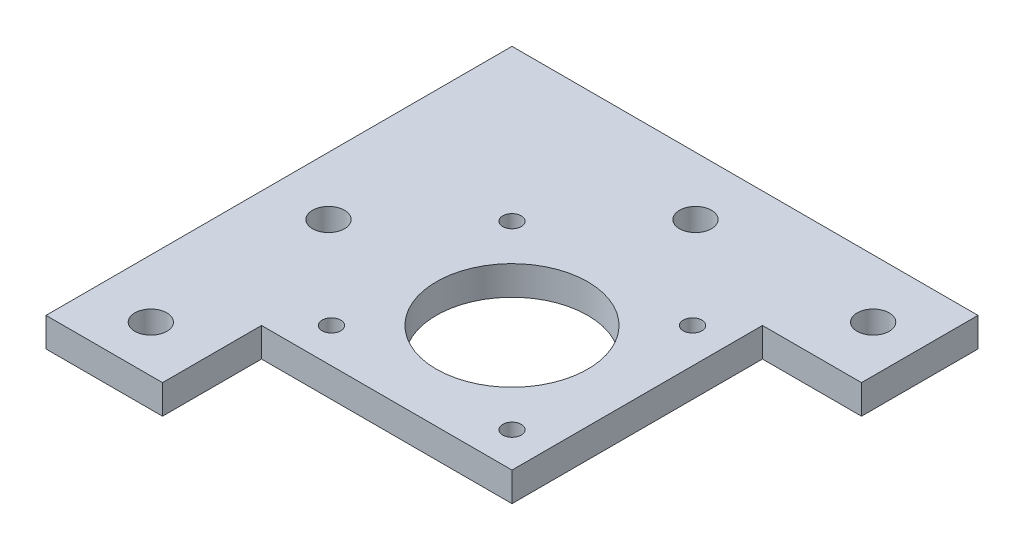
ISO-10303-21;
HEADER;
FILE_DESCRIPTION(('STEP AP214'),'2;1');
FILE_NAME('part.step','',(''),(''),'','','');
FILE_SCHEMA(('AUTOMOTIVE_DESIGN { 1 0 10303 214 1 1 1 1 }'));
ENDSEC;
DATA;
#1=APPLICATION_CONTEXT('core data for automotive mechanical design processes');
#2=APPLICATION_PROTOCOL_DEFINITION('international standard','automotive_design',2000,#1);
#3=PRODUCT_CONTEXT('',#1,'mechanical');
#4=PRODUCT('Part','Part','',(#3));
#5=PRODUCT_RELATED_PRODUCT_CATEGORY('part','',(#4));
#6=PRODUCT_DEFINITION_FORMATION('','',#4);
#7=PRODUCT_DEFINITION_CONTEXT('part definition',#1,'design');
#8=PRODUCT_DEFINITION('design','',#6,#7);
#9=PRODUCT_DEFINITION_SHAPE('','',#8);
#10=(LENGTH_UNIT() NAMED_UNIT(*) SI_UNIT(.MILLI.,.METRE.));
#11=(NAMED_UNIT(*) PLANE_ANGLE_UNIT() SI_UNIT($,.RADIAN.));
#12=(NAMED_UNIT(*) SI_UNIT($,.STERADIAN.) SOLID_ANGLE_UNIT());
#13=UNCERTAINTY_MEASURE_WITH_UNIT(LENGTH_MEASURE(1.E-05),#10,'distance_accuracy_value','');
#14=(GEOMETRIC_REPRESENTATION_CONTEXT(3) GLOBAL_UNCERTAINTY_ASSIGNED_CONTEXT((#13)) GLOBAL_UNIT_ASSIGNED_CONTEXT((#10,
#11,#12)) REPRESENTATION_CONTEXT('',''));
#15=CARTESIAN_POINT('',(0.,0.,0.));
#16=DIRECTION('',(0.,0.,1.));
#17=DIRECTION('',(1.,0.,0.));
#18=AXIS2_PLACEMENT_3D('',#15,#16,#17);
#19=CARTESIAN_POINT('',(0.,5.,0.));
#20=DIRECTION('',(0.,1.,0.));
#21=DIRECTION('',(0.,0.,1.));
#22=AXIS2_PLACEMENT_3D('',#19,#20,#21);
#23=PLANE('',#22);
#24=CARTESIAN_POINT('',(72.,5.,-70.));
#25=DIRECTION('',(0.,1.,0.));
#26=DIRECTION('',(0.,0.,1.));
#27=AXIS2_PLACEMENT_3D('',#24,#25,#26);
#28=CIRCLE('',#27,2.75000000000001);
#29=CARTESIAN_POINT('',(72.,5.,-67.25));
#30=VERTEX_POINT('',#29);
#31=EDGE_CURVE('E261',#30,#30,#28,.T.);
#32=ORIENTED_EDGE('',*,*,#31,.F.);
#33=EDGE_LOOP('',(#32));
#34=FACE_BOUND('',#33,.T.);
#35=CARTESIAN_POINT('',(10.,5.,-7.99999999999999));
#36=DIRECTION('',(0.,1.,0.));
#37=DIRECTION('',(0.,0.,1.));
#38=AXIS2_PLACEMENT_3D('',#35,#36,#37);
#39=CIRCLE('',#38,2.75);
#40=CARTESIAN_POINT('',(10.,5.,-5.25));
#41=VERTEX_POINT('',#40);
#42=EDGE_CURVE('E245',#41,#41,#39,.T.);
#43=ORIENTED_EDGE('',*,*,#42,.F.);
#44=EDGE_LOOP('',(#43));
#45=FACE_BOUND('',#44,.T.);
#46=CARTESIAN_POINT('',(26.,5.,-54.));
#47=DIRECTION('',(0.,1.,0.));
#48=DIRECTION('',(0.,0.,1.));
#49=AXIS2_PLACEMENT_3D('',#46,#47,#48);
#50=CIRCLE('',#49,1.6);
#51=CARTESIAN_POINT('',(26.,5.,-52.4));
#52=VERTEX_POINT('',#51);
#53=EDGE_CURVE('E229',#52,#52,#50,.T.);
#54=ORIENTED_EDGE('',*,*,#53,.F.);
#55=EDGE_LOOP('',(#54));
#56=FACE_BOUND('',#55,.T.);
#57=CARTESIAN_POINT('',(57.,5.,-54.));
#58=DIRECTION('',(0.,1.,0.));
#59=DIRECTION('',(0.,0.,1.));
#60=AXIS2_PLACEMENT_3D('',#57,#58,#59);
#61=CIRCLE('',#60,1.6);
#62=CARTESIAN_POINT('',(57.,5.,-52.4));
#63=VERTEX_POINT('',#62);
#64=EDGE_CURVE('E213',#63,#63,#61,.T.);
#65=ORIENTED_EDGE('',*,*,#64,.F.);
#66=EDGE_LOOP('',(#65));
#67=FACE_BOUND('',#66,.T.);
#68=DIRECTION('',(0.,0.,1.));
#69=VECTOR('',#68,1.);
#70=CARTESIAN_POINT('',(0.,5.,-80.));
#71=LINE('',#70,#69);
#72=CARTESIAN_POINT('',(0.,5.,-80.));
#73=VERTEX_POINT('',#72);
#74=CARTESIAN_POINT('',(0.,5.,0.));
#75=VERTEX_POINT('',#74);
#76=EDGE_CURVE('E164',#73,#75,#71,.T.);
#77=ORIENTED_EDGE('',*,*,#76,.T.);
#78=DIRECTION('',(1.,0.,0.));
#79=VECTOR('',#78,1.);
#80=CARTESIAN_POINT('',(0.,5.,0.));
#81=LINE('',#80,#79);
#82=CARTESIAN_POINT('',(20.,5.,0.));
#83=VERTEX_POINT('',#82);
#84=EDGE_CURVE('E100',#75,#83,#81,.T.);
#85=ORIENTED_EDGE('',*,*,#84,.T.);
#86=DIRECTION('',(0.,0.,-1.));
#87=VECTOR('',#86,1.);
#88=CARTESIAN_POINT('',(20.,5.,0.));
#89=LINE('',#88,#87);
#90=CARTESIAN_POINT('',(20.,5.,-17.));
#91=VERTEX_POINT('',#90);
#92=EDGE_CURVE('E185',#83,#91,#89,.T.);
#93=ORIENTED_EDGE('',*,*,#92,.T.);
#94=DIRECTION('',(1.,0.,0.));
#95=VECTOR('',#94,1.);
#96=CARTESIAN_POINT('',(20.,5.,-17.));
#97=LINE('',#96,#95);
#98=CARTESIAN_POINT('',(63.,5.,-17.));
#99=VERTEX_POINT('',#98);
#100=EDGE_CURVE('E199',#91,#99,#97,.T.);
#101=ORIENTED_EDGE('',*,*,#100,.T.);
#102=DIRECTION('',(0.,0.,-1.));
#103=VECTOR('',#102,1.);
#104=CARTESIAN_POINT('',(63.,5.,-17.));
#105=LINE('',#104,#103);
#106=CARTESIAN_POINT('',(63.,5.,-60.));
#107=VERTEX_POINT('',#106);
#108=EDGE_CURVE('E119',#99,#107,#105,.T.);
#109=ORIENTED_EDGE('',*,*,#108,.T.);
#110=DIRECTION('',(1.,0.,0.));
#111=VECTOR('',#110,1.);
#112=CARTESIAN_POINT('',(63.,5.,-60.));
#113=LINE('',#112,#111);
#114=CARTESIAN_POINT('',(80.,5.,-60.));
#115=VERTEX_POINT('',#114);
#116=EDGE_CURVE('E113',#107,#115,#113,.T.);
#117=ORIENTED_EDGE('',*,*,#116,.T.);
#118=DIRECTION('',(0.,0.,-1.));
#119=VECTOR('',#118,1.);
#120=CARTESIAN_POINT('',(80.,5.,-60.));
#121=LINE('',#120,#119);
#122=CARTESIAN_POINT('',(80.,5.,-80.));
#123=VERTEX_POINT('',#122);
#124=EDGE_CURVE('E117',#115,#123,#121,.T.);
#125=ORIENTED_EDGE('',*,*,#124,.T.);
#126=DIRECTION('',(-1.,0.,0.));
#127=VECTOR('',#126,1.);
#128=CARTESIAN_POINT('',(80.,5.,-80.));
#129=LINE('',#128,#127);
#130=EDGE_CURVE('E57',#123,#73,#129,.T.);
#131=ORIENTED_EDGE('',*,*,#130,.T.);
#132=EDGE_LOOP('',(#77,#85,#93,#101,#109,#117,#125,#131));
#133=FACE_BOUND('',#132,.T.);
#134=CARTESIAN_POINT('',(57.,5.,-23.));
#135=DIRECTION('',(0.,1.,0.));
#136=DIRECTION('',(0.,0.,1.));
#137=AXIS2_PLACEMENT_3D('',#134,#135,#136);
#138=CIRCLE('',#137,1.6);
#139=CARTESIAN_POINT('',(57.,5.,-21.4));
#140=VERTEX_POINT('',#139);
#141=EDGE_CURVE('E146',#140,#140,#138,.T.);
#142=ORIENTED_EDGE('',*,*,#141,.F.);
#143=EDGE_LOOP('',(#142));
#144=FACE_BOUND('',#143,.T.);
#145=CARTESIAN_POINT('',(26.,5.,-23.));
#146=DIRECTION('',(0.,1.,0.));
#147=DIRECTION('',(0.,0.,1.));
#148=AXIS2_PLACEMENT_3D('',#145,#146,#147);
#149=CIRCLE('',#148,1.6);
#150=CARTESIAN_POINT('',(26.,5.,-21.4));
#151=VERTEX_POINT('',#150);
#152=EDGE_CURVE('E221',#151,#151,#149,.T.);
#153=ORIENTED_EDGE('',*,*,#152,.F.);
#154=EDGE_LOOP('',(#153));
#155=FACE_BOUND('',#154,.T.);
#156=CARTESIAN_POINT('',(41.5,5.,-38.5));
#157=DIRECTION('',(0.,1.,0.));
#158=DIRECTION('',(0.,0.,1.));
#159=AXIS2_PLACEMENT_3D('',#156,#157,#158);
#160=CIRCLE('',#159,13.);
#161=CARTESIAN_POINT('',(41.5,5.,-25.5));
#162=VERTEX_POINT('',#161);
#163=EDGE_CURVE('E237',#162,#162,#160,.T.);
#164=ORIENTED_EDGE('',*,*,#163,.F.);
#165=EDGE_LOOP('',(#164));
#166=FACE_BOUND('',#165,.T.);
#167=CARTESIAN_POINT('',(41.5,5.,-70.));
#168=DIRECTION('',(0.,1.,0.));
#169=DIRECTION('',(0.,0.,1.));
#170=AXIS2_PLACEMENT_3D('',#167,#168,#169);
#171=CIRCLE('',#170,2.75);
#172=CARTESIAN_POINT('',(41.5,5.,-67.25));
#173=VERTEX_POINT('',#172);
#174=EDGE_CURVE('E253',#173,#173,#171,.T.);
#175=ORIENTED_EDGE('',*,*,#174,.F.);
#176=EDGE_LOOP('',(#175));
#177=FACE_BOUND('',#176,.T.);
#178=CARTESIAN_POINT('',(10.,5.,-38.5));
#179=DIRECTION('',(0.,1.,0.));
#180=DIRECTION('',(0.,0.,1.));
#181=AXIS2_PLACEMENT_3D('',#178,#179,#180);
#182=CIRCLE('',#181,2.75);
#183=CARTESIAN_POINT('',(10.,5.,-35.75));
#184=VERTEX_POINT('',#183);
#185=EDGE_CURVE('E269',#184,#184,#182,.T.);
#186=ORIENTED_EDGE('',*,*,#185,.F.);
#187=EDGE_LOOP('',(#186));
#188=FACE_BOUND('',#187,.T.);
#189=ADVANCED_FACE('F39',(#34,#45,#56,#67,#133,#144,#155,#166,#177,#188),#23,.T.);
#190=CARTESIAN_POINT('',(0.,0.,0.));
#191=DIRECTION('',(0.,1.,0.));
#192=DIRECTION('',(0.,0.,1.));
#193=AXIS2_PLACEMENT_3D('',#190,#191,#192);
#194=PLANE('',#193);
#195=DIRECTION('',(0.,0.,1.));
#196=VECTOR('',#195,1.);
#197=CARTESIAN_POINT('',(0.,0.,-80.));
#198=LINE('',#197,#196);
#199=CARTESIAN_POINT('',(0.,0.,-80.));
#200=VERTEX_POINT('',#199);
#201=CARTESIAN_POINT('',(0.,0.,0.));
#202=VERTEX_POINT('',#201);
#203=EDGE_CURVE('E141',#200,#202,#198,.T.);
#204=ORIENTED_EDGE('',*,*,#203,.F.);
#205=DIRECTION('',(-1.,0.,0.));
#206=VECTOR('',#205,1.);
#207=CARTESIAN_POINT('',(80.,0.,-80.));
#208=LINE('',#207,#206);
#209=CARTESIAN_POINT('',(80.,0.,-80.));
#210=VERTEX_POINT('',#209);
#211=EDGE_CURVE('E92',#210,#200,#208,.T.);
#212=ORIENTED_EDGE('',*,*,#211,.F.);
#213=DIRECTION('',(0.,0.,-1.));
#214=VECTOR('',#213,1.);
#215=CARTESIAN_POINT('',(80.,0.,-60.));
#216=LINE('',#215,#214);
#217=CARTESIAN_POINT('',(80.,0.,-60.));
#218=VERTEX_POINT('',#217);
#219=EDGE_CURVE('E86',#218,#210,#216,.T.);
#220=ORIENTED_EDGE('',*,*,#219,.F.);
#221=DIRECTION('',(1.,0.,0.));
#222=VECTOR('',#221,1.);
#223=CARTESIAN_POINT('',(63.,0.,-60.));
#224=LINE('',#223,#222);
#225=CARTESIAN_POINT('',(63.,0.,-60.));
#226=VERTEX_POINT('',#225);
#227=EDGE_CURVE('E128',#226,#218,#224,.T.);
#228=ORIENTED_EDGE('',*,*,#227,.F.);
#229=DIRECTION('',(0.,0.,-1.));
#230=VECTOR('',#229,1.);
#231=CARTESIAN_POINT('',(63.,0.,-17.));
#232=LINE('',#231,#230);
#233=CARTESIAN_POINT('',(63.,0.,-17.));
#234=VERTEX_POINT('',#233);
#235=EDGE_CURVE('E155',#234,#226,#232,.T.);
#236=ORIENTED_EDGE('',*,*,#235,.F.);
#237=DIRECTION('',(1.,0.,0.));
#238=VECTOR('',#237,1.);
#239=CARTESIAN_POINT('',(20.,0.,-17.));
#240=LINE('',#239,#238);
#241=CARTESIAN_POINT('',(20.,0.,-17.));
#242=VERTEX_POINT('',#241);
#243=EDGE_CURVE('E152',#242,#234,#240,.T.);
#244=ORIENTED_EDGE('',*,*,#243,.F.);
#245=DIRECTION('',(0.,0.,-1.));
#246=VECTOR('',#245,1.);
#247=CARTESIAN_POINT('',(20.,0.,0.));
#248=LINE('',#247,#246);
#249=CARTESIAN_POINT('',(20.,0.,0.));
#250=VERTEX_POINT('',#249);
#251=EDGE_CURVE('E149',#250,#242,#248,.T.);
#252=ORIENTED_EDGE('',*,*,#251,.F.);
#253=DIRECTION('',(1.,0.,0.));
#254=VECTOR('',#253,1.);
#255=CARTESIAN_POINT('',(0.,0.,0.));
#256=LINE('',#255,#254);
#257=EDGE_CURVE('E145',#202,#250,#256,.T.);
#258=ORIENTED_EDGE('',*,*,#257,.F.);
#259=EDGE_LOOP('',(#204,#212,#220,#228,#236,#244,#252,#258));
#260=FACE_BOUND('',#259,.T.);
#261=CARTESIAN_POINT('',(57.,0.,-23.));
#262=DIRECTION('',(0.,1.,0.));
#263=DIRECTION('',(0.,0.,1.));
#264=AXIS2_PLACEMENT_3D('',#261,#262,#263);
#265=CIRCLE('',#264,1.6);
#266=CARTESIAN_POINT('',(57.,0.,-21.4));
#267=VERTEX_POINT('',#266);
#268=EDGE_CURVE('E209',#267,#267,#265,.T.);
#269=ORIENTED_EDGE('',*,*,#268,.T.);
#270=EDGE_LOOP('',(#269));
#271=FACE_BOUND('',#270,.T.);
#272=CARTESIAN_POINT('',(57.,0.,-54.));
#273=DIRECTION('',(0.,1.,0.));
#274=DIRECTION('',(0.,0.,1.));
#275=AXIS2_PLACEMENT_3D('',#272,#273,#274);
#276=CIRCLE('',#275,1.6);
#277=CARTESIAN_POINT('',(57.,0.,-52.4));
#278=VERTEX_POINT('',#277);
#279=EDGE_CURVE('E217',#278,#278,#276,.T.);
#280=ORIENTED_EDGE('',*,*,#279,.T.);
#281=EDGE_LOOP('',(#280));
#282=FACE_BOUND('',#281,.T.);
#283=CARTESIAN_POINT('',(26.,0.,-23.));
#284=DIRECTION('',(0.,1.,0.));
#285=DIRECTION('',(0.,0.,1.));
#286=AXIS2_PLACEMENT_3D('',#283,#284,#285);
#287=CIRCLE('',#286,1.6);
#288=CARTESIAN_POINT('',(26.,0.,-21.4));
#289=VERTEX_POINT('',#288);
#290=EDGE_CURVE('E225',#289,#289,#287,.T.);
#291=ORIENTED_EDGE('',*,*,#290,.T.);
#292=EDGE_LOOP('',(#291));
#293=FACE_BOUND('',#292,.T.);
#294=CARTESIAN_POINT('',(26.,0.,-54.));
#295=DIRECTION('',(0.,1.,0.));
#296=DIRECTION('',(0.,0.,1.));
#297=AXIS2_PLACEMENT_3D('',#294,#295,#296);
#298=CIRCLE('',#297,1.6);
#299=CARTESIAN_POINT('',(26.,0.,-52.4));
#300=VERTEX_POINT('',#299);
#301=EDGE_CURVE('E233',#300,#300,#298,.T.);
#302=ORIENTED_EDGE('',*,*,#301,.T.);
#303=EDGE_LOOP('',(#302));
#304=FACE_BOUND('',#303,.T.);
#305=CARTESIAN_POINT('',(41.5,0.,-38.5));
#306=DIRECTION('',(0.,1.,0.));
#307=DIRECTION('',(0.,0.,1.));
#308=AXIS2_PLACEMENT_3D('',#305,#306,#307);
#309=CIRCLE('',#308,13.);
#310=CARTESIAN_POINT('',(41.5,0.,-25.5));
#311=VERTEX_POINT('',#310);
#312=EDGE_CURVE('E241',#311,#311,#309,.T.);
#313=ORIENTED_EDGE('',*,*,#312,.T.);
#314=EDGE_LOOP('',(#313));
#315=FACE_BOUND('',#314,.T.);
#316=CARTESIAN_POINT('',(10.,0.,-7.99999999999999));
#317=DIRECTION('',(0.,1.,0.));
#318=DIRECTION('',(0.,0.,1.));
#319=AXIS2_PLACEMENT_3D('',#316,#317,#318);
#320=CIRCLE('',#319,2.75);
#321=CARTESIAN_POINT('',(10.,0.,-5.25));
#322=VERTEX_POINT('',#321);
#323=EDGE_CURVE('E249',#322,#322,#320,.T.);
#324=ORIENTED_EDGE('',*,*,#323,.T.);
#325=EDGE_LOOP('',(#324));
#326=FACE_BOUND('',#325,.T.);
#327=CARTESIAN_POINT('',(41.5,0.,-70.));
#328=DIRECTION('',(0.,1.,0.));
#329=DIRECTION('',(0.,0.,1.));
#330=AXIS2_PLACEMENT_3D('',#327,#328,#329);
#331=CIRCLE('',#330,2.75);
#332=CARTESIAN_POINT('',(41.5,0.,-67.25));
#333=VERTEX_POINT('',#332);
#334=EDGE_CURVE('E257',#333,#333,#331,.T.);
#335=ORIENTED_EDGE('',*,*,#334,.T.);
#336=EDGE_LOOP('',(#335));
#337=FACE_BOUND('',#336,.T.);
#338=CARTESIAN_POINT('',(72.,0.,-70.));
#339=DIRECTION('',(0.,1.,0.));
#340=DIRECTION('',(0.,0.,1.));
#341=AXIS2_PLACEMENT_3D('',#338,#339,#340);
#342=CIRCLE('',#341,2.75000000000001);
#343=CARTESIAN_POINT('',(72.,0.,-67.25));
#344=VERTEX_POINT('',#343);
#345=EDGE_CURVE('E265',#344,#344,#342,.T.);
#346=ORIENTED_EDGE('',*,*,#345,.T.);
#347=EDGE_LOOP('',(#346));
#348=FACE_BOUND('',#347,.T.);
#349=CARTESIAN_POINT('',(10.,0.,-38.5));
#350=DIRECTION('',(0.,1.,0.));
#351=DIRECTION('',(0.,0.,1.));
#352=AXIS2_PLACEMENT_3D('',#349,#350,#351);
#353=CIRCLE('',#352,2.75);
#354=CARTESIAN_POINT('',(10.,0.,-35.75));
#355=VERTEX_POINT('',#354);
#356=EDGE_CURVE('E273',#355,#355,#353,.T.);
#357=ORIENTED_EDGE('',*,*,#356,.T.);
#358=EDGE_LOOP('',(#357));
#359=FACE_BOUND('',#358,.T.);
#360=ADVANCED_FACE('F189',(#260,#271,#282,#293,#304,#315,#326,#337,#348,#359),#194,.F.);
#361=CARTESIAN_POINT('',(0.,5.,-80.));
#362=DIRECTION('',(1.,0.,0.));
#363=DIRECTION('',(0.,0.,-1.));
#364=AXIS2_PLACEMENT_3D('',#361,#362,#363);
#365=PLANE('',#364);
#366=ORIENTED_EDGE('',*,*,#203,.T.);
#367=DIRECTION('',(0.,-1.,0.));
#368=VECTOR('',#367,1.);
#369=CARTESIAN_POINT('',(0.,5.,0.));
#370=LINE('',#369,#368);
#371=EDGE_CURVE('E11',#75,#202,#370,.T.);
#372=ORIENTED_EDGE('',*,*,#371,.F.);
#373=ORIENTED_EDGE('',*,*,#76,.F.);
#374=DIRECTION('',(0.,-1.,0.));
#375=VECTOR('',#374,1.);
#376=CARTESIAN_POINT('',(0.,5.,-80.));
#377=LINE('',#376,#375);
#378=EDGE_CURVE('E137',#73,#200,#377,.T.);
#379=ORIENTED_EDGE('',*,*,#378,.T.);
#380=EDGE_LOOP('',(#366,#372,#373,#379));
#381=FACE_BOUND('',#380,.T.);
#382=ADVANCED_FACE('F41',(#381),#365,.F.);
#383=CARTESIAN_POINT('',(0.,5.,0.));
#384=DIRECTION('',(0.,0.,-1.));
#385=DIRECTION('',(-1.,0.,0.));
#386=AXIS2_PLACEMENT_3D('',#383,#384,#385);
#387=PLANE('',#386);
#388=ORIENTED_EDGE('',*,*,#257,.T.);
#389=DIRECTION('',(0.,-1.,0.));
#390=VECTOR('',#389,1.);
#391=CARTESIAN_POINT('',(20.,5.,0.));
#392=LINE('',#391,#390);
#393=EDGE_CURVE('E49',#83,#250,#392,.T.);
#394=ORIENTED_EDGE('',*,*,#393,.F.);
#395=ORIENTED_EDGE('',*,*,#84,.F.);
#396=ORIENTED_EDGE('',*,*,#371,.T.);
#397=EDGE_LOOP('',(#388,#394,#395,#396));
#398=FACE_BOUND('',#397,.T.);
#399=ADVANCED_FACE('F309',(#398),#387,.F.);
#400=CARTESIAN_POINT('',(20.,5.,0.));
#401=DIRECTION('',(-1.,0.,0.));
#402=DIRECTION('',(0.,0.,1.));
#403=AXIS2_PLACEMENT_3D('',#400,#401,#402);
#404=PLANE('',#403);
#405=ORIENTED_EDGE('',*,*,#251,.T.);
#406=DIRECTION('',(0.,-1.,0.));
#407=VECTOR('',#406,1.);
#408=CARTESIAN_POINT('',(20.,5.,-17.));
#409=LINE('',#408,#407);
#410=EDGE_CURVE('E175',#91,#242,#409,.T.);
#411=ORIENTED_EDGE('',*,*,#410,.F.);
#412=ORIENTED_EDGE('',*,*,#92,.F.);
#413=ORIENTED_EDGE('',*,*,#393,.T.);
#414=EDGE_LOOP('',(#405,#411,#412,#413));
#415=FACE_BOUND('',#414,.T.);
#416=ADVANCED_FACE('F183',(#415),#404,.F.);
#417=CARTESIAN_POINT('',(20.,5.,-17.));
#418=DIRECTION('',(0.,0.,-1.));
#419=DIRECTION('',(-1.,0.,0.));
#420=AXIS2_PLACEMENT_3D('',#417,#418,#419);
#421=PLANE('',#420);
#422=ORIENTED_EDGE('',*,*,#243,.T.);
#423=DIRECTION('',(0.,-1.,0.));
#424=VECTOR('',#423,1.);
#425=CARTESIAN_POINT('',(63.,5.,-17.));
#426=LINE('',#425,#424);
#427=EDGE_CURVE('E171',#99,#234,#426,.T.);
#428=ORIENTED_EDGE('',*,*,#427,.F.);
#429=ORIENTED_EDGE('',*,*,#100,.F.);
#430=ORIENTED_EDGE('',*,*,#410,.T.);
#431=EDGE_LOOP('',(#422,#428,#429,#430));
#432=FACE_BOUND('',#431,.T.);
#433=ADVANCED_FACE('F194',(#432),#421,.F.);
#434=CARTESIAN_POINT('',(63.,5.,-17.));
#435=DIRECTION('',(-1.,0.,0.));
#436=DIRECTION('',(0.,0.,1.));
#437=AXIS2_PLACEMENT_3D('',#434,#435,#436);
#438=PLANE('',#437);
#439=ORIENTED_EDGE('',*,*,#235,.T.);
#440=DIRECTION('',(0.,-1.,0.));
#441=VECTOR('',#440,1.);
#442=CARTESIAN_POINT('',(63.,5.,-60.));
#443=LINE('',#442,#441);
#444=EDGE_CURVE('E130',#107,#226,#443,.T.);
#445=ORIENTED_EDGE('',*,*,#444,.F.);
#446=ORIENTED_EDGE('',*,*,#108,.F.);
#447=ORIENTED_EDGE('',*,*,#427,.T.);
#448=EDGE_LOOP('',(#439,#445,#446,#447));
#449=FACE_BOUND('',#448,.T.);
#450=ADVANCED_FACE('F197',(#449),#438,.F.);
#451=CARTESIAN_POINT('',(63.,5.,-60.));
#452=DIRECTION('',(0.,0.,-1.));
#453=DIRECTION('',(-1.,0.,0.));
#454=AXIS2_PLACEMENT_3D('',#451,#452,#453);
#455=PLANE('',#454);
#456=ORIENTED_EDGE('',*,*,#227,.T.);
#457=DIRECTION('',(0.,-1.,0.));
#458=VECTOR('',#457,1.);
#459=CARTESIAN_POINT('',(80.,5.,-60.));
#460=LINE('',#459,#458);
#461=EDGE_CURVE('E125',#115,#218,#460,.T.);
#462=ORIENTED_EDGE('',*,*,#461,.F.);
#463=ORIENTED_EDGE('',*,*,#116,.F.);
#464=ORIENTED_EDGE('',*,*,#444,.T.);
#465=EDGE_LOOP('',(#456,#462,#463,#464));
#466=FACE_BOUND('',#465,.T.);
#467=ADVANCED_FACE('F126',(#466),#455,.F.);
#468=CARTESIAN_POINT('',(80.,5.,-60.));
#469=DIRECTION('',(-1.,0.,0.));
#470=DIRECTION('',(0.,0.,1.));
#471=AXIS2_PLACEMENT_3D('',#468,#469,#470);
#472=PLANE('',#471);
#473=ORIENTED_EDGE('',*,*,#219,.T.);
#474=DIRECTION('',(0.,-1.,0.));
#475=VECTOR('',#474,1.);
#476=CARTESIAN_POINT('',(80.,5.,-80.));
#477=LINE('',#476,#475);
#478=EDGE_CURVE('E131',#123,#210,#477,.T.);
#479=ORIENTED_EDGE('',*,*,#478,.F.);
#480=ORIENTED_EDGE('',*,*,#124,.F.);
#481=ORIENTED_EDGE('',*,*,#461,.T.);
#482=EDGE_LOOP('',(#473,#479,#480,#481));
#483=FACE_BOUND('',#482,.T.);
#484=ADVANCED_FACE('F133',(#483),#472,.F.);
#485=CARTESIAN_POINT('',(80.,5.,-80.));
#486=DIRECTION('',(0.,0.,1.));
#487=DIRECTION('',(1.,0.,0.));
#488=AXIS2_PLACEMENT_3D('',#485,#486,#487);
#489=PLANE('',#488);
#490=ORIENTED_EDGE('',*,*,#211,.T.);
#491=ORIENTED_EDGE('',*,*,#378,.F.);
#492=ORIENTED_EDGE('',*,*,#130,.F.);
#493=ORIENTED_EDGE('',*,*,#478,.T.);
#494=EDGE_LOOP('',(#490,#491,#492,#493));
#495=FACE_BOUND('',#494,.T.);
#496=ADVANCED_FACE('F297',(#495),#489,.F.);
#497=CARTESIAN_POINT('',(57.,5.,-23.));
#498=DIRECTION('',(0.,-1.,0.));
#499=DIRECTION('',(0.,0.,-1.));
#500=AXIS2_PLACEMENT_3D('',#497,#498,#499);
#501=CYLINDRICAL_SURFACE('',#500,1.6);
#502=ORIENTED_EDGE('',*,*,#141,.T.);
#503=EDGE_LOOP('',(#502));
#504=FACE_BOUND('',#503,.T.);
#505=ORIENTED_EDGE('',*,*,#268,.F.);
#506=EDGE_LOOP('',(#505));
#507=FACE_BOUND('',#506,.T.);
#508=ADVANCED_FACE('F294',(#504,#507),#501,.F.);
#509=CARTESIAN_POINT('',(57.,5.,-54.));
#510=DIRECTION('',(0.,-1.,0.));
#511=DIRECTION('',(0.,0.,-1.));
#512=AXIS2_PLACEMENT_3D('',#509,#510,#511);
#513=CYLINDRICAL_SURFACE('',#512,1.6);
#514=ORIENTED_EDGE('',*,*,#64,.T.);
#515=EDGE_LOOP('',(#514));
#516=FACE_BOUND('',#515,.T.);
#517=ORIENTED_EDGE('',*,*,#279,.F.);
#518=EDGE_LOOP('',(#517));
#519=FACE_BOUND('',#518,.T.);
#520=ADVANCED_FACE('F373',(#516,#519),#513,.F.);
#521=CARTESIAN_POINT('',(26.,5.,-23.));
#522=DIRECTION('',(0.,-1.,0.));
#523=DIRECTION('',(0.,0.,-1.));
#524=AXIS2_PLACEMENT_3D('',#521,#522,#523);
#525=CYLINDRICAL_SURFACE('',#524,1.6);
#526=ORIENTED_EDGE('',*,*,#152,.T.);
#527=EDGE_LOOP('',(#526));
#528=FACE_BOUND('',#527,.T.);
#529=ORIENTED_EDGE('',*,*,#290,.F.);
#530=EDGE_LOOP('',(#529));
#531=FACE_BOUND('',#530,.T.);
#532=ADVANCED_FACE('F381',(#528,#531),#525,.F.);
#533=CARTESIAN_POINT('',(26.,5.,-54.));
#534=DIRECTION('',(0.,-1.,0.));
#535=DIRECTION('',(0.,0.,-1.));
#536=AXIS2_PLACEMENT_3D('',#533,#534,#535);
#537=CYLINDRICAL_SURFACE('',#536,1.6);
#538=ORIENTED_EDGE('',*,*,#53,.T.);
#539=EDGE_LOOP('',(#538));
#540=FACE_BOUND('',#539,.T.);
#541=ORIENTED_EDGE('',*,*,#301,.F.);
#542=EDGE_LOOP('',(#541));
#543=FACE_BOUND('',#542,.T.);
#544=ADVANCED_FACE('F389',(#540,#543),#537,.F.);
#545=CARTESIAN_POINT('',(41.5,5.,-38.5));
#546=DIRECTION('',(0.,-1.,0.));
#547=DIRECTION('',(0.,0.,-1.));
#548=AXIS2_PLACEMENT_3D('',#545,#546,#547);
#549=CYLINDRICAL_SURFACE('',#548,13.);
#550=ORIENTED_EDGE('',*,*,#163,.T.);
#551=EDGE_LOOP('',(#550));
#552=FACE_BOUND('',#551,.T.);
#553=ORIENTED_EDGE('',*,*,#312,.F.);
#554=EDGE_LOOP('',(#553));
#555=FACE_BOUND('',#554,.T.);
#556=ADVANCED_FACE('F398',(#552,#555),#549,.F.);
#557=CARTESIAN_POINT('',(10.,5.,-7.99999999999999));
#558=DIRECTION('',(0.,-1.,0.));
#559=DIRECTION('',(0.,0.,-1.));
#560=AXIS2_PLACEMENT_3D('',#557,#558,#559);
#561=CYLINDRICAL_SURFACE('',#560,2.75);
#562=ORIENTED_EDGE('',*,*,#42,.T.);
#563=EDGE_LOOP('',(#562));
#564=FACE_BOUND('',#563,.T.);
#565=ORIENTED_EDGE('',*,*,#323,.F.);
#566=EDGE_LOOP('',(#565));
#567=FACE_BOUND('',#566,.T.);
#568=ADVANCED_FACE('F407',(#564,#567),#561,.F.);
#569=CARTESIAN_POINT('',(41.5,5.,-70.));
#570=DIRECTION('',(0.,-1.,0.));
#571=DIRECTION('',(0.,0.,-1.));
#572=AXIS2_PLACEMENT_3D('',#569,#570,#571);
#573=CYLINDRICAL_SURFACE('',#572,2.75);
#574=ORIENTED_EDGE('',*,*,#174,.T.);
#575=EDGE_LOOP('',(#574));
#576=FACE_BOUND('',#575,.T.);
#577=ORIENTED_EDGE('',*,*,#334,.F.);
#578=EDGE_LOOP('',(#577));
#579=FACE_BOUND('',#578,.T.);
#580=ADVANCED_FACE('F416',(#576,#579),#573,.F.);
#581=CARTESIAN_POINT('',(72.,5.,-70.));
#582=DIRECTION('',(0.,-1.,0.));
#583=DIRECTION('',(0.,0.,-1.));
#584=AXIS2_PLACEMENT_3D('',#581,#582,#583);
#585=CYLINDRICAL_SURFACE('',#584,2.75000000000001);
#586=ORIENTED_EDGE('',*,*,#31,.T.);
#587=EDGE_LOOP('',(#586));
#588=FACE_BOUND('',#587,.T.);
#589=ORIENTED_EDGE('',*,*,#345,.F.);
#590=EDGE_LOOP('',(#589));
#591=FACE_BOUND('',#590,.T.);
#592=ADVANCED_FACE('F425',(#588,#591),#585,.F.);
#593=CARTESIAN_POINT('',(10.,5.,-38.5));
#594=DIRECTION('',(0.,-1.,0.));
#595=DIRECTION('',(0.,0.,-1.));
#596=AXIS2_PLACEMENT_3D('',#593,#594,#595);
#597=CYLINDRICAL_SURFACE('',#596,2.75);
#598=ORIENTED_EDGE('',*,*,#185,.T.);
#599=EDGE_LOOP('',(#598));
#600=FACE_BOUND('',#599,.T.);
#601=ORIENTED_EDGE('',*,*,#356,.F.);
#602=EDGE_LOOP('',(#601));
#603=FACE_BOUND('',#602,.T.);
#604=ADVANCED_FACE('F281',(#600,#603),#597,.F.);
#605=CLOSED_SHELL('',(#189,#360,#382,#399,#416,#433,#450,#467,#484,#496,#508,#520,#532,#544,
#556,#568,#580,#592,#604));
#606=MANIFOLD_SOLID_BREP('B2',#605);
#607=ADVANCED_BREP_SHAPE_REPRESENTATION('',(#18,#606),#14);
#608=SHAPE_DEFINITION_REPRESENTATION(#9,#607);
ENDSEC;
END-ISO-10303-21;
